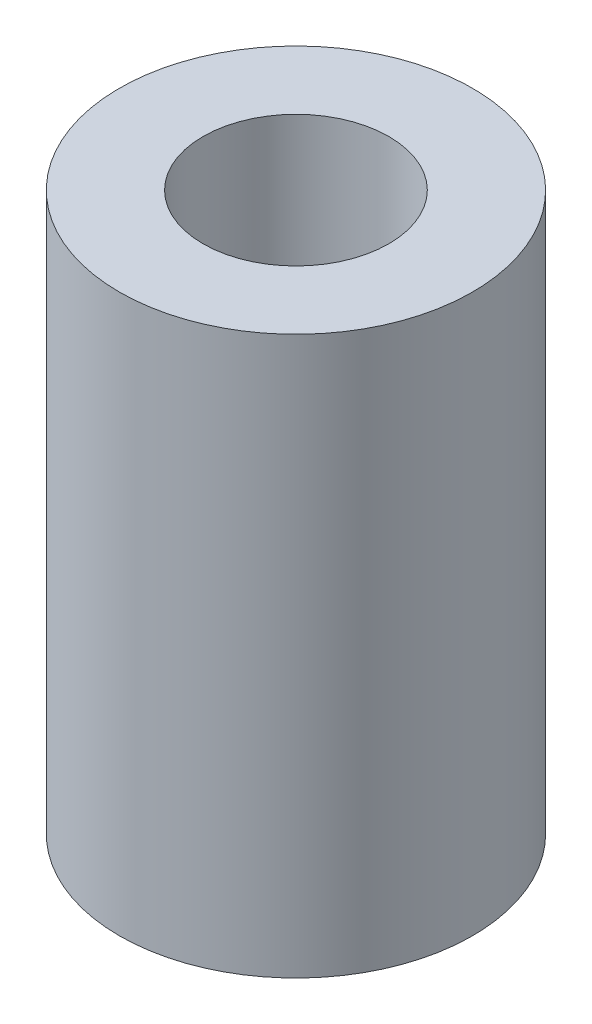
ISO-10303-21;
HEADER;
FILE_DESCRIPTION(('STEP AP214'),'2;1');
FILE_NAME('part.step','',(''),(''),'','','');
FILE_SCHEMA(('AUTOMOTIVE_DESIGN { 1 0 10303 214 1 1 1 1 }'));
ENDSEC;
DATA;
#1=APPLICATION_CONTEXT('core data for automotive mechanical design processes');
#2=APPLICATION_PROTOCOL_DEFINITION('international standard','automotive_design',2000,#1);
#3=PRODUCT_CONTEXT('',#1,'mechanical');
#4=PRODUCT('Part','Part','',(#3));
#5=PRODUCT_RELATED_PRODUCT_CATEGORY('part','',(#4));
#6=PRODUCT_DEFINITION_FORMATION('','',#4);
#7=PRODUCT_DEFINITION_CONTEXT('part definition',#1,'design');
#8=PRODUCT_DEFINITION('design','',#6,#7);
#9=PRODUCT_DEFINITION_SHAPE('','',#8);
#10=(LENGTH_UNIT() NAMED_UNIT(*) SI_UNIT(.MILLI.,.METRE.));
#11=(NAMED_UNIT(*) PLANE_ANGLE_UNIT() SI_UNIT($,.RADIAN.));
#12=(NAMED_UNIT(*) SI_UNIT($,.STERADIAN.) SOLID_ANGLE_UNIT());
#13=UNCERTAINTY_MEASURE_WITH_UNIT(LENGTH_MEASURE(1.E-05),#10,'distance_accuracy_value','');
#14=(GEOMETRIC_REPRESENTATION_CONTEXT(3) GLOBAL_UNCERTAINTY_ASSIGNED_CONTEXT((#13)) GLOBAL_UNIT_ASSIGNED_CONTEXT((#10,
#11,#12)) REPRESENTATION_CONTEXT('',''));
#15=CARTESIAN_POINT('',(0.,0.,0.));
#16=DIRECTION('',(0.,0.,1.));
#17=DIRECTION('',(1.,0.,0.));
#18=AXIS2_PLACEMENT_3D('',#15,#16,#17);
#19=CARTESIAN_POINT('',(0.,30.,0.));
#20=DIRECTION('',(0.,1.,0.));
#21=DIRECTION('',(0.,0.,1.));
#22=AXIS2_PLACEMENT_3D('',#19,#20,#21);
#23=PLANE('',#22);
#24=CARTESIAN_POINT('',(0.,30.,0.));
#25=DIRECTION('',(0.,1.,0.));
#26=DIRECTION('',(0.,0.,1.));
#27=AXIS2_PLACEMENT_3D('',#24,#25,#26);
#28=CIRCLE('',#27,9.5);
#29=CARTESIAN_POINT('',(0.,30.,9.5));
#30=VERTEX_POINT('',#29);
#31=EDGE_CURVE('E10',#30,#30,#28,.T.);
#32=ORIENTED_EDGE('',*,*,#31,.T.);
#33=EDGE_LOOP('',(#32));
#34=FACE_BOUND('',#33,.T.);
#35=CARTESIAN_POINT('',(0.,30.,0.));
#36=DIRECTION('',(0.,1.,0.));
#37=DIRECTION('',(0.,0.,1.));
#38=AXIS2_PLACEMENT_3D('',#35,#36,#37);
#39=CIRCLE('',#38,5.);
#40=CARTESIAN_POINT('',(0.,30.,5.));
#41=VERTEX_POINT('',#40);
#42=EDGE_CURVE('E50',#41,#41,#39,.T.);
#43=ORIENTED_EDGE('',*,*,#42,.F.);
#44=EDGE_LOOP('',(#43));
#45=FACE_BOUND('',#44,.T.);
#46=ADVANCED_FACE('F37',(#34,#45),#23,.T.);
#47=CARTESIAN_POINT('',(0.,0.,0.));
#48=DIRECTION('',(0.,1.,0.));
#49=DIRECTION('',(0.,0.,1.));
#50=AXIS2_PLACEMENT_3D('',#47,#48,#49);
#51=PLANE('',#50);
#52=CARTESIAN_POINT('',(0.,0.,0.));
#53=DIRECTION('',(0.,1.,0.));
#54=DIRECTION('',(0.,0.,1.));
#55=AXIS2_PLACEMENT_3D('',#52,#53,#54);
#56=CIRCLE('',#55,9.5);
#57=CARTESIAN_POINT('',(0.,0.,9.5));
#58=VERTEX_POINT('',#57);
#59=EDGE_CURVE('E41',#58,#58,#56,.T.);
#60=ORIENTED_EDGE('',*,*,#59,.F.);
#61=EDGE_LOOP('',(#60));
#62=FACE_BOUND('',#61,.T.);
#63=CARTESIAN_POINT('',(0.,0.,0.));
#64=DIRECTION('',(0.,1.,0.));
#65=DIRECTION('',(0.,0.,1.));
#66=AXIS2_PLACEMENT_3D('',#63,#64,#65);
#67=CIRCLE('',#66,5.);
#68=CARTESIAN_POINT('',(0.,0.,5.));
#69=VERTEX_POINT('',#68);
#70=EDGE_CURVE('E52',#69,#69,#67,.T.);
#71=ORIENTED_EDGE('',*,*,#70,.T.);
#72=EDGE_LOOP('',(#71));
#73=FACE_BOUND('',#72,.T.);
#74=ADVANCED_FACE('F64',(#62,#73),#51,.F.);
#75=CARTESIAN_POINT('',(0.,30.,0.));
#76=DIRECTION('',(0.,-1.,0.));
#77=DIRECTION('',(0.,0.,-1.));
#78=AXIS2_PLACEMENT_3D('',#75,#76,#77);
#79=CYLINDRICAL_SURFACE('',#78,9.5);
#80=ORIENTED_EDGE('',*,*,#31,.F.);
#81=EDGE_LOOP('',(#80));
#82=FACE_BOUND('',#81,.T.);
#83=ORIENTED_EDGE('',*,*,#59,.T.);
#84=EDGE_LOOP('',(#83));
#85=FACE_BOUND('',#84,.T.);
#86=ADVANCED_FACE('F39',(#82,#85),#79,.T.);
#87=CARTESIAN_POINT('',(0.,30.,0.));
#88=DIRECTION('',(0.,-1.,0.));
#89=DIRECTION('',(0.,0.,-1.));
#90=AXIS2_PLACEMENT_3D('',#87,#88,#89);
#91=CYLINDRICAL_SURFACE('',#90,5.);
#92=ORIENTED_EDGE('',*,*,#42,.T.);
#93=EDGE_LOOP('',(#92));
#94=FACE_BOUND('',#93,.T.);
#95=ORIENTED_EDGE('',*,*,#70,.F.);
#96=EDGE_LOOP('',(#95));
#97=FACE_BOUND('',#96,.T.);
#98=ADVANCED_FACE('F60',(#94,#97),#91,.F.);
#99=CLOSED_SHELL('',(#46,#74,#86,#98));
#100=MANIFOLD_SOLID_BREP('B2',#99);
#101=ADVANCED_BREP_SHAPE_REPRESENTATION('',(#18,#100),#14);
#102=SHAPE_DEFINITION_REPRESENTATION(#9,#101);
ENDSEC;
END-ISO-10303-21;
